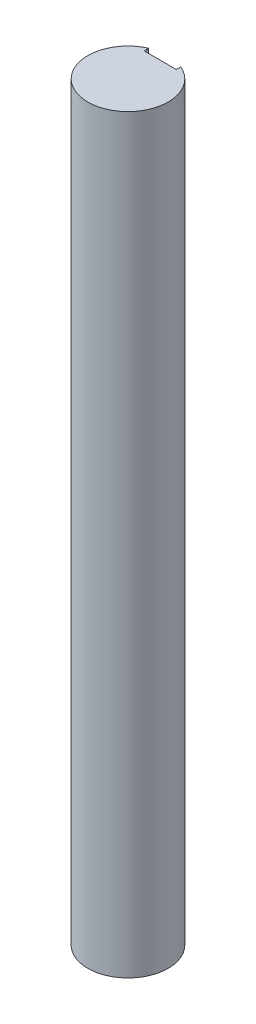
ISO-10303-21;
HEADER;
FILE_DESCRIPTION(('STEP AP214'),'2;1');
FILE_NAME('part.step','',(''),(''),'','','');
FILE_SCHEMA(('AUTOMOTIVE_DESIGN { 1 0 10303 214 1 1 1 1 }'));
ENDSEC;
DATA;
#1=APPLICATION_CONTEXT('core data for automotive mechanical design processes');
#2=APPLICATION_PROTOCOL_DEFINITION('international standard','automotive_design',2000,#1);
#3=PRODUCT_CONTEXT('',#1,'mechanical');
#4=PRODUCT('Part','Part','',(#3));
#5=PRODUCT_RELATED_PRODUCT_CATEGORY('part','',(#4));
#6=PRODUCT_DEFINITION_FORMATION('','',#4);
#7=PRODUCT_DEFINITION_CONTEXT('part definition',#1,'design');
#8=PRODUCT_DEFINITION('design','',#6,#7);
#9=PRODUCT_DEFINITION_SHAPE('','',#8);
#10=(LENGTH_UNIT() NAMED_UNIT(*) SI_UNIT(.MILLI.,.METRE.));
#11=(NAMED_UNIT(*) PLANE_ANGLE_UNIT() SI_UNIT($,.RADIAN.));
#12=(NAMED_UNIT(*) SI_UNIT($,.STERADIAN.) SOLID_ANGLE_UNIT());
#13=UNCERTAINTY_MEASURE_WITH_UNIT(LENGTH_MEASURE(1.E-05),#10,'distance_accuracy_value','');
#14=(GEOMETRIC_REPRESENTATION_CONTEXT(3) GLOBAL_UNCERTAINTY_ASSIGNED_CONTEXT((#13)) GLOBAL_UNIT_ASSIGNED_CONTEXT((#10,
#11,#12)) REPRESENTATION_CONTEXT('',''));
#15=CARTESIAN_POINT('',(0.,0.,0.));
#16=DIRECTION('',(0.,0.,1.));
#17=DIRECTION('',(1.,0.,0.));
#18=AXIS2_PLACEMENT_3D('',#15,#16,#17);
#19=CARTESIAN_POINT('',(0.,70.,0.));
#20=DIRECTION('',(0.,-1.,0.));
#21=DIRECTION('',(0.,0.,-1.));
#22=AXIS2_PLACEMENT_3D('',#19,#20,#21);
#23=CYLINDRICAL_SURFACE('',#22,3.75);
#24=CARTESIAN_POINT('',(0.,70.,0.));
#25=DIRECTION('',(0.,1.,0.));
#26=DIRECTION('',(0.,0.,1.));
#27=AXIS2_PLACEMENT_3D('',#24,#25,#26);
#28=CIRCLE('',#27,3.75);
#29=CARTESIAN_POINT('',(-1.5,70.,-3.43693177121688));
#30=VERTEX_POINT('',#29);
#31=CARTESIAN_POINT('',(1.5,70.,-3.43693177121688));
#32=VERTEX_POINT('',#31);
#33=EDGE_CURVE('E40',#30,#32,#28,.T.);
#34=ORIENTED_EDGE('',*,*,#33,.F.);
#35=DIRECTION('',(0.,-1.,0.));
#36=VECTOR('',#35,1.);
#37=CARTESIAN_POINT('',(-1.5,70.,-3.43693177121688));
#38=LINE('',#37,#36);
#39=CARTESIAN_POINT('',(-1.5,0.,-3.43693177121688));
#40=VERTEX_POINT('',#39);
#41=EDGE_CURVE('E98',#30,#40,#38,.T.);
#42=ORIENTED_EDGE('',*,*,#41,.T.);
#43=CARTESIAN_POINT('',(0.,0.,0.));
#44=DIRECTION('',(0.,1.,0.));
#45=DIRECTION('',(0.,0.,1.));
#46=AXIS2_PLACEMENT_3D('',#43,#44,#45);
#47=CIRCLE('',#46,3.75);
#48=CARTESIAN_POINT('',(1.5,0.,-3.43693177121688));
#49=VERTEX_POINT('',#48);
#50=EDGE_CURVE('E100',#40,#49,#47,.T.);
#51=ORIENTED_EDGE('',*,*,#50,.T.);
#52=DIRECTION('',(0.,-1.,0.));
#53=VECTOR('',#52,1.);
#54=CARTESIAN_POINT('',(1.5,70.,-3.43693177121688));
#55=LINE('',#54,#53);
#56=EDGE_CURVE('E47',#49,#32,#55,.F.);
#57=ORIENTED_EDGE('',*,*,#56,.T.);
#58=EDGE_LOOP('',(#34,#42,#51,#57));
#59=FACE_BOUND('',#58,.T.);
#60=ADVANCED_FACE('F33',(#59),#23,.T.);
#61=CARTESIAN_POINT('',(0.,70.,0.));
#62=DIRECTION('',(0.,1.,0.));
#63=DIRECTION('',(0.,0.,1.));
#64=AXIS2_PLACEMENT_3D('',#61,#62,#63);
#65=PLANE('',#64);
#66=DIRECTION('',(0.,0.,1.));
#67=VECTOR('',#66,1.);
#68=CARTESIAN_POINT('',(-1.5,70.,-3.01053179065747));
#69=LINE('',#68,#67);
#70=CARTESIAN_POINT('',(-1.5,70.,-3.01053179065747));
#71=VERTEX_POINT('',#70);
#72=EDGE_CURVE('E90',#30,#71,#69,.T.);
#73=ORIENTED_EDGE('',*,*,#72,.F.);
#74=ORIENTED_EDGE('',*,*,#33,.T.);
#75=DIRECTION('',(0.,0.,-1.));
#76=VECTOR('',#75,1.);
#77=CARTESIAN_POINT('',(1.5,70.,-3.01053179065747));
#78=LINE('',#77,#76);
#79=CARTESIAN_POINT('',(1.5,70.,-3.01053179065747));
#80=VERTEX_POINT('',#79);
#81=EDGE_CURVE('E93',#80,#32,#78,.T.);
#82=ORIENTED_EDGE('',*,*,#81,.F.);
#83=DIRECTION('',(1.,0.,0.));
#84=VECTOR('',#83,1.);
#85=CARTESIAN_POINT('',(0.,70.,-3.01053179065747));
#86=LINE('',#85,#84);
#87=EDGE_CURVE('E78',#71,#80,#86,.T.);
#88=ORIENTED_EDGE('',*,*,#87,.F.);
#89=EDGE_LOOP('',(#73,#74,#82,#88));
#90=FACE_BOUND('',#89,.T.);
#91=ADVANCED_FACE('F107',(#90),#65,.T.);
#92=CARTESIAN_POINT('',(0.,0.,0.));
#93=DIRECTION('',(0.,1.,0.));
#94=DIRECTION('',(0.,0.,1.));
#95=AXIS2_PLACEMENT_3D('',#92,#93,#94);
#96=PLANE('',#95);
#97=ORIENTED_EDGE('',*,*,#50,.F.);
#98=DIRECTION('',(0.,0.,1.));
#99=VECTOR('',#98,1.);
#100=CARTESIAN_POINT('',(-1.5,0.,0.));
#101=LINE('',#100,#99);
#102=CARTESIAN_POINT('',(-1.5,0.,-3.01053179065747));
#103=VERTEX_POINT('',#102);
#104=EDGE_CURVE('E11',#40,#103,#101,.T.);
#105=ORIENTED_EDGE('',*,*,#104,.T.);
#106=DIRECTION('',(1.,0.,0.));
#107=VECTOR('',#106,1.);
#108=CARTESIAN_POINT('',(0.,0.,-3.01053179065747));
#109=LINE('',#108,#107);
#110=CARTESIAN_POINT('',(1.5,0.,-3.01053179065747));
#111=VERTEX_POINT('',#110);
#112=EDGE_CURVE('E76',#103,#111,#109,.T.);
#113=ORIENTED_EDGE('',*,*,#112,.T.);
#114=DIRECTION('',(0.,0.,-1.));
#115=VECTOR('',#114,1.);
#116=CARTESIAN_POINT('',(1.5,0.,-3.01053179065747));
#117=LINE('',#116,#115);
#118=EDGE_CURVE('E81',#111,#49,#117,.T.);
#119=ORIENTED_EDGE('',*,*,#118,.T.);
#120=EDGE_LOOP('',(#97,#105,#113,#119));
#121=FACE_BOUND('',#120,.T.);
#122=ADVANCED_FACE('F88',(#121),#96,.F.);
#123=CARTESIAN_POINT('',(-1.5,0.,-3.01053179065747));
#124=DIRECTION('',(-1.,0.,0.));
#125=DIRECTION('',(0.,0.,1.));
#126=AXIS2_PLACEMENT_3D('',#123,#124,#125);
#127=PLANE('',#126);
#128=ORIENTED_EDGE('',*,*,#72,.T.);
#129=DIRECTION('',(0.,1.,0.));
#130=VECTOR('',#129,1.);
#131=CARTESIAN_POINT('',(-1.5,0.,-3.01053179065747));
#132=LINE('',#131,#130);
#133=EDGE_CURVE('E80',#103,#71,#132,.T.);
#134=ORIENTED_EDGE('',*,*,#133,.F.);
#135=ORIENTED_EDGE('',*,*,#104,.F.);
#136=ORIENTED_EDGE('',*,*,#41,.F.);
#137=EDGE_LOOP('',(#128,#134,#135,#136));
#138=FACE_BOUND('',#137,.T.);
#139=ADVANCED_FACE('F105',(#138),#127,.F.);
#140=CARTESIAN_POINT('',(1.5,0.,-3.01053179065747));
#141=DIRECTION('',(1.,0.,0.));
#142=DIRECTION('',(0.,0.,-1.));
#143=AXIS2_PLACEMENT_3D('',#140,#141,#142);
#144=PLANE('',#143);
#145=ORIENTED_EDGE('',*,*,#118,.F.);
#146=DIRECTION('',(0.,1.,0.));
#147=VECTOR('',#146,1.);
#148=CARTESIAN_POINT('',(1.5,0.,-3.01053179065747));
#149=LINE('',#148,#147);
#150=EDGE_CURVE('E72',#111,#80,#149,.T.);
#151=ORIENTED_EDGE('',*,*,#150,.T.);
#152=ORIENTED_EDGE('',*,*,#81,.T.);
#153=ORIENTED_EDGE('',*,*,#56,.F.);
#154=EDGE_LOOP('',(#145,#151,#152,#153));
#155=FACE_BOUND('',#154,.T.);
#156=ADVANCED_FACE('F83',(#155),#144,.F.);
#157=CARTESIAN_POINT('',(0.,0.,-3.01053179065747));
#158=DIRECTION('',(0.,0.,1.));
#159=DIRECTION('',(1.,0.,0.));
#160=AXIS2_PLACEMENT_3D('',#157,#158,#159);
#161=PLANE('',#160);
#162=ORIENTED_EDGE('',*,*,#87,.T.);
#163=ORIENTED_EDGE('',*,*,#150,.F.);
#164=ORIENTED_EDGE('',*,*,#112,.F.);
#165=ORIENTED_EDGE('',*,*,#133,.T.);
#166=EDGE_LOOP('',(#162,#163,#164,#165));
#167=FACE_BOUND('',#166,.T.);
#168=ADVANCED_FACE('F73',(#167),#161,.F.);
#169=CLOSED_SHELL('',(#60,#91,#122,#139,#156,#168));
#170=MANIFOLD_SOLID_BREP('B2',#169);
#171=ADVANCED_BREP_SHAPE_REPRESENTATION('',(#18,#170),#14);
#172=SHAPE_DEFINITION_REPRESENTATION(#9,#171);
ENDSEC;
END-ISO-10303-21;
